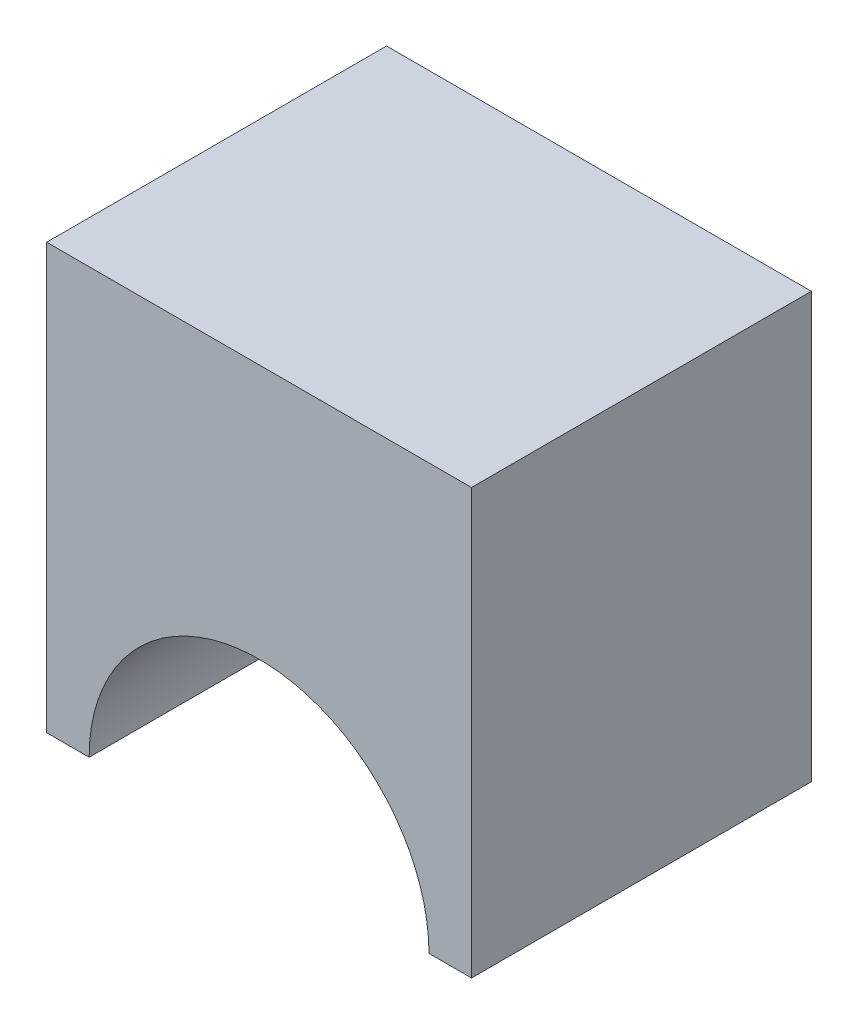
ISO-10303-21;
HEADER;
FILE_DESCRIPTION(('STEP AP214'),'2;1');
FILE_NAME('part.step','',(''),(''),'','','');
FILE_SCHEMA(('AUTOMOTIVE_DESIGN { 1 0 10303 214 1 1 1 1 }'));
ENDSEC;
DATA;
#1=APPLICATION_CONTEXT('core data for automotive mechanical design processes');
#2=APPLICATION_PROTOCOL_DEFINITION('international standard','automotive_design',2000,#1);
#3=PRODUCT_CONTEXT('',#1,'mechanical');
#4=PRODUCT('Part','Part','',(#3));
#5=PRODUCT_RELATED_PRODUCT_CATEGORY('part','',(#4));
#6=PRODUCT_DEFINITION_FORMATION('','',#4);
#7=PRODUCT_DEFINITION_CONTEXT('part definition',#1,'design');
#8=PRODUCT_DEFINITION('design','',#6,#7);
#9=PRODUCT_DEFINITION_SHAPE('','',#8);
#10=(LENGTH_UNIT() NAMED_UNIT(*) SI_UNIT(.MILLI.,.METRE.));
#11=(NAMED_UNIT(*) PLANE_ANGLE_UNIT() SI_UNIT($,.RADIAN.));
#12=(NAMED_UNIT(*) SI_UNIT($,.STERADIAN.) SOLID_ANGLE_UNIT());
#13=UNCERTAINTY_MEASURE_WITH_UNIT(LENGTH_MEASURE(1.E-05),#10,'distance_accuracy_value','');
#14=(GEOMETRIC_REPRESENTATION_CONTEXT(3) GLOBAL_UNCERTAINTY_ASSIGNED_CONTEXT((#13)) GLOBAL_UNIT_ASSIGNED_CONTEXT((#10,
#11,#12)) REPRESENTATION_CONTEXT('',''));
#15=CARTESIAN_POINT('',(0.,0.,0.));
#16=DIRECTION('',(0.,0.,1.));
#17=DIRECTION('',(1.,0.,0.));
#18=AXIS2_PLACEMENT_3D('',#15,#16,#17);
#19=CARTESIAN_POINT('',(0.5,0.,0.));
#20=DIRECTION('',(1.,0.,0.));
#21=DIRECTION('',(0.,1.,0.));
#22=AXIS2_PLACEMENT_3D('',#19,#20,#21);
#23=PLANE('',#22);
#24=DIRECTION('',(0.,0.,-1.));
#25=VECTOR('',#24,1.);
#26=CARTESIAN_POINT('',(0.5,1.,0.));
#27=LINE('',#26,#25);
#28=CARTESIAN_POINT('',(0.5,1.,0.4));
#29=VERTEX_POINT('',#28);
#30=CARTESIAN_POINT('',(0.5,1.,-0.4));
#31=VERTEX_POINT('',#30);
#32=EDGE_CURVE('E11',#29,#31,#27,.T.);
#33=ORIENTED_EDGE('',*,*,#32,.F.);
#34=DIRECTION('',(0.,1.,0.));
#35=VECTOR('',#34,1.);
#36=CARTESIAN_POINT('',(0.5,0.540739649358,0.4));
#37=LINE('',#36,#35);
#38=CARTESIAN_POINT('',(0.5,0.,0.4));
#39=VERTEX_POINT('',#38);
#40=EDGE_CURVE('E135',#39,#29,#37,.T.);
#41=ORIENTED_EDGE('',*,*,#40,.F.);
#42=DIRECTION('',(0.,0.,1.));
#43=VECTOR('',#42,1.);
#44=CARTESIAN_POINT('',(0.5,0.,0.));
#45=LINE('',#44,#43);
#46=CARTESIAN_POINT('',(0.5,0.,-0.4));
#47=VERTEX_POINT('',#46);
#48=EDGE_CURVE('E112',#47,#39,#45,.T.);
#49=ORIENTED_EDGE('',*,*,#48,.F.);
#50=DIRECTION('',(0.,1.,0.));
#51=VECTOR('',#50,1.);
#52=CARTESIAN_POINT('',(0.5,0.540739649358,-0.4));
#53=LINE('',#52,#51);
#54=EDGE_CURVE('E116',#47,#31,#53,.T.);
#55=ORIENTED_EDGE('',*,*,#54,.T.);
#56=EDGE_LOOP('',(#33,#41,#49,#55));
#57=FACE_BOUND('',#56,.T.);
#58=ADVANCED_FACE('F17',(#57),#23,.T.);
#59=CARTESIAN_POINT('',(0.5,1.,0.));
#60=DIRECTION('',(0.,1.,0.));
#61=DIRECTION('',(1.,0.,0.));
#62=AXIS2_PLACEMENT_3D('',#59,#60,#61);
#63=PLANE('',#62);
#64=DIRECTION('',(0.,0.,-1.));
#65=VECTOR('',#64,1.);
#66=CARTESIAN_POINT('',(-0.5,1.,0.));
#67=LINE('',#66,#65);
#68=CARTESIAN_POINT('',(-0.5,1.,0.4));
#69=VERTEX_POINT('',#68);
#70=CARTESIAN_POINT('',(-0.5,1.,-0.4));
#71=VERTEX_POINT('',#70);
#72=EDGE_CURVE('E25',#69,#71,#67,.T.);
#73=ORIENTED_EDGE('',*,*,#72,.F.);
#74=DIRECTION('',(-1.,0.,0.));
#75=VECTOR('',#74,1.);
#76=CARTESIAN_POINT('',(0.,1.,0.4));
#77=LINE('',#76,#75);
#78=EDGE_CURVE('E108',#29,#69,#77,.T.);
#79=ORIENTED_EDGE('',*,*,#78,.F.);
#80=ORIENTED_EDGE('',*,*,#32,.T.);
#81=DIRECTION('',(-1.,0.,0.));
#82=VECTOR('',#81,1.);
#83=CARTESIAN_POINT('',(0.,1.,-0.4));
#84=LINE('',#83,#82);
#85=EDGE_CURVE('E81',#31,#71,#84,.T.);
#86=ORIENTED_EDGE('',*,*,#85,.T.);
#87=EDGE_LOOP('',(#73,#79,#80,#86));
#88=FACE_BOUND('',#87,.T.);
#89=ADVANCED_FACE('F146',(#88),#63,.T.);
#90=CARTESIAN_POINT('',(-0.5,1.,0.));
#91=DIRECTION('',(-1.,0.,0.));
#92=DIRECTION('',(0.,1.,0.));
#93=AXIS2_PLACEMENT_3D('',#90,#91,#92);
#94=PLANE('',#93);
#95=DIRECTION('',(0.,0.,-1.));
#96=VECTOR('',#95,1.);
#97=CARTESIAN_POINT('',(-0.5,0.,0.));
#98=LINE('',#97,#96);
#99=CARTESIAN_POINT('',(-0.5,0.,0.4));
#100=VERTEX_POINT('',#99);
#101=CARTESIAN_POINT('',(-0.5,0.,-0.4));
#102=VERTEX_POINT('',#101);
#103=EDGE_CURVE('E76',#100,#102,#98,.T.);
#104=ORIENTED_EDGE('',*,*,#103,.F.);
#105=DIRECTION('',(0.,-1.,0.));
#106=VECTOR('',#105,1.);
#107=CARTESIAN_POINT('',(-0.5,0.540739649358,0.4));
#108=LINE('',#107,#106);
#109=EDGE_CURVE('E102',#69,#100,#108,.T.);
#110=ORIENTED_EDGE('',*,*,#109,.F.);
#111=ORIENTED_EDGE('',*,*,#72,.T.);
#112=DIRECTION('',(0.,-1.,0.));
#113=VECTOR('',#112,1.);
#114=CARTESIAN_POINT('',(-0.5,0.540739649358,-0.4));
#115=LINE('',#114,#113);
#116=EDGE_CURVE('E72',#71,#102,#115,.T.);
#117=ORIENTED_EDGE('',*,*,#116,.T.);
#118=EDGE_LOOP('',(#104,#110,#111,#117));
#119=FACE_BOUND('',#118,.T.);
#120=ADVANCED_FACE('F74',(#119),#94,.T.);
#121=CARTESIAN_POINT('',(0.4,0.,0.));
#122=DIRECTION('',(0.,-1.,0.));
#123=DIRECTION('',(0.,0.,-1.));
#124=AXIS2_PLACEMENT_3D('',#121,#122,#123);
#125=PLANE('',#124);
#126=ORIENTED_EDGE('',*,*,#48,.T.);
#127=DIRECTION('',(1.,0.,0.));
#128=VECTOR('',#127,1.);
#129=CARTESIAN_POINT('',(0.,0.,0.4));
#130=LINE('',#129,#128);
#131=CARTESIAN_POINT('',(0.4,0.,0.4));
#132=VERTEX_POINT('',#131);
#133=EDGE_CURVE('E131',#132,#39,#130,.T.);
#134=ORIENTED_EDGE('',*,*,#133,.F.);
#135=DIRECTION('',(0.,0.,-1.));
#136=VECTOR('',#135,1.);
#137=CARTESIAN_POINT('',(0.4,0.,0.));
#138=LINE('',#137,#136);
#139=CARTESIAN_POINT('',(0.4,0.,-0.4));
#140=VERTEX_POINT('',#139);
#141=EDGE_CURVE('E152',#132,#140,#138,.T.);
#142=ORIENTED_EDGE('',*,*,#141,.T.);
#143=DIRECTION('',(1.,0.,0.));
#144=VECTOR('',#143,1.);
#145=CARTESIAN_POINT('',(0.,0.,-0.4));
#146=LINE('',#145,#144);
#147=EDGE_CURVE('E82',#140,#47,#146,.T.);
#148=ORIENTED_EDGE('',*,*,#147,.T.);
#149=EDGE_LOOP('',(#126,#134,#142,#148));
#150=FACE_BOUND('',#149,.T.);
#151=ADVANCED_FACE('F150',(#150),#125,.T.);
#152=CARTESIAN_POINT('',(0.,0.540739649358,-0.4));
#153=DIRECTION('',(0.,0.,1.));
#154=DIRECTION('',(1.,0.,0.));
#155=AXIS2_PLACEMENT_3D('',#152,#153,#154);
#156=PLANE('',#155);
#157=ORIENTED_EDGE('',*,*,#147,.F.);
#158=CARTESIAN_POINT('',(0.,0.,-0.4));
#159=DIRECTION('',(0.,0.,1.));
#160=DIRECTION('',(1.,0.,0.));
#161=AXIS2_PLACEMENT_3D('',#158,#159,#160);
#162=CIRCLE('',#161,0.4);
#163=CARTESIAN_POINT('',(-0.4,0.,-0.4));
#164=VERTEX_POINT('',#163);
#165=EDGE_CURVE('E91',#140,#164,#162,.T.);
#166=ORIENTED_EDGE('',*,*,#165,.T.);
#167=DIRECTION('',(1.,0.,0.));
#168=VECTOR('',#167,1.);
#169=CARTESIAN_POINT('',(-0.5,0.,-0.4));
#170=LINE('',#169,#168);
#171=EDGE_CURVE('E86',#102,#164,#170,.T.);
#172=ORIENTED_EDGE('',*,*,#171,.F.);
#173=ORIENTED_EDGE('',*,*,#116,.F.);
#174=ORIENTED_EDGE('',*,*,#85,.F.);
#175=ORIENTED_EDGE('',*,*,#54,.F.);
#176=EDGE_LOOP('',(#157,#166,#172,#173,#174,#175));
#177=FACE_BOUND('',#176,.T.);
#178=ADVANCED_FACE('F88',(#177),#156,.F.);
#179=CARTESIAN_POINT('',(-0.5,0.,0.));
#180=DIRECTION('',(0.,-1.,0.));
#181=DIRECTION('',(0.,0.,-1.));
#182=AXIS2_PLACEMENT_3D('',#179,#180,#181);
#183=PLANE('',#182);
#184=DIRECTION('',(0.,0.,1.));
#185=VECTOR('',#184,1.);
#186=CARTESIAN_POINT('',(-0.4,0.,0.));
#187=LINE('',#186,#185);
#188=CARTESIAN_POINT('',(-0.4,0.,0.4));
#189=VERTEX_POINT('',#188);
#190=EDGE_CURVE('E159',#164,#189,#187,.T.);
#191=ORIENTED_EDGE('',*,*,#190,.T.);
#192=DIRECTION('',(1.,0.,0.));
#193=VECTOR('',#192,1.);
#194=CARTESIAN_POINT('',(0.,0.,0.4));
#195=LINE('',#194,#193);
#196=EDGE_CURVE('E100',#100,#189,#195,.T.);
#197=ORIENTED_EDGE('',*,*,#196,.F.);
#198=ORIENTED_EDGE('',*,*,#103,.T.);
#199=ORIENTED_EDGE('',*,*,#171,.T.);
#200=EDGE_LOOP('',(#191,#197,#198,#199));
#201=FACE_BOUND('',#200,.T.);
#202=ADVANCED_FACE('F98',(#201),#183,.T.);
#203=CARTESIAN_POINT('',(0.,0.540739649358,0.4));
#204=DIRECTION('',(0.,0.,1.));
#205=DIRECTION('',(1.,0.,0.));
#206=AXIS2_PLACEMENT_3D('',#203,#204,#205);
#207=PLANE('',#206);
#208=ORIENTED_EDGE('',*,*,#196,.T.);
#209=CARTESIAN_POINT('',(0.,0.,0.4));
#210=DIRECTION('',(0.,0.,-1.));
#211=DIRECTION('',(1.,0.,0.));
#212=AXIS2_PLACEMENT_3D('',#209,#210,#211);
#213=CIRCLE('',#212,0.4);
#214=EDGE_CURVE('E127',#189,#132,#213,.T.);
#215=ORIENTED_EDGE('',*,*,#214,.T.);
#216=ORIENTED_EDGE('',*,*,#133,.T.);
#217=ORIENTED_EDGE('',*,*,#40,.T.);
#218=ORIENTED_EDGE('',*,*,#78,.T.);
#219=ORIENTED_EDGE('',*,*,#109,.T.);
#220=EDGE_LOOP('',(#208,#215,#216,#217,#218,#219));
#221=FACE_BOUND('',#220,.T.);
#222=ADVANCED_FACE('F212',(#221),#207,.T.);
#223=CARTESIAN_POINT('',(0.,0.,0.));
#224=DIRECTION('',(0.,0.,1.));
#225=DIRECTION('',(1.,0.,0.));
#226=AXIS2_PLACEMENT_3D('',#223,#224,#225);
#227=CYLINDRICAL_SURFACE('',#226,0.4);
#228=ORIENTED_EDGE('',*,*,#190,.F.);
#229=ORIENTED_EDGE('',*,*,#165,.F.);
#230=ORIENTED_EDGE('',*,*,#141,.F.);
#231=ORIENTED_EDGE('',*,*,#214,.F.);
#232=EDGE_LOOP('',(#228,#229,#230,#231));
#233=FACE_BOUND('',#232,.T.);
#234=ADVANCED_FACE('F158',(#233),#227,.F.);
#235=CLOSED_SHELL('',(#58,#89,#120,#151,#178,#202,#222,#234));
#236=MANIFOLD_SOLID_BREP('B1',#235);
#237=ADVANCED_BREP_SHAPE_REPRESENTATION('',(#18,#236),#14);
#238=SHAPE_DEFINITION_REPRESENTATION(#9,#237);
ENDSEC;
END-ISO-10303-21;
